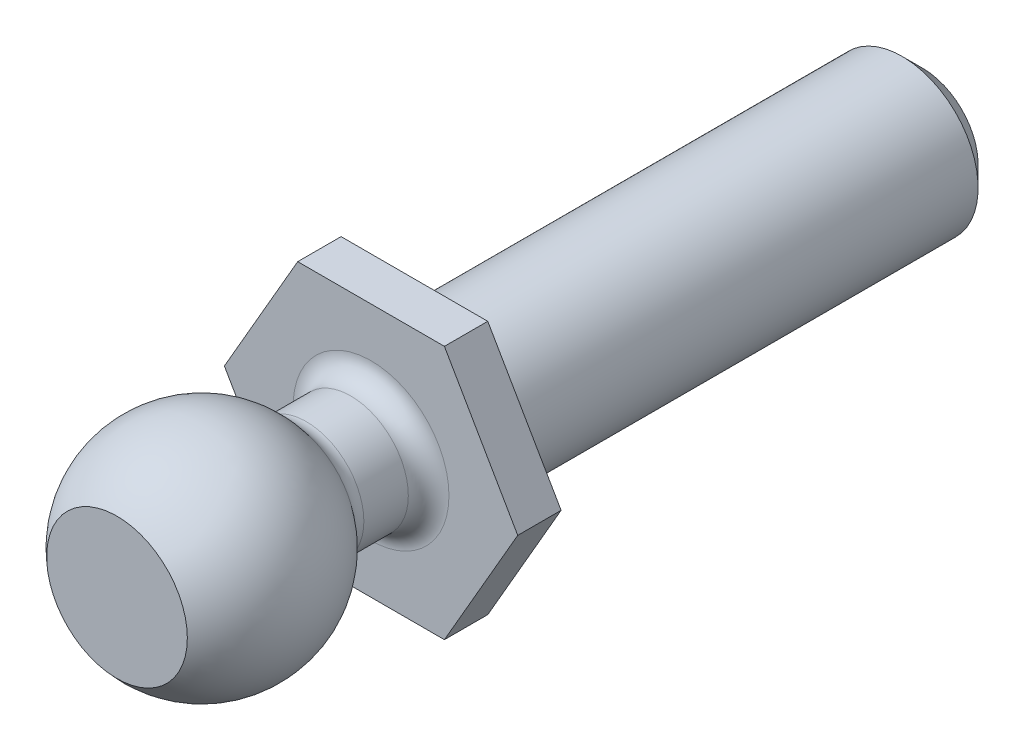
ISO-10303-21;
HEADER;
FILE_DESCRIPTION(('STEP AP214'),'2;1');
FILE_NAME('part.step','',(''),(''),'','','');
FILE_SCHEMA(('AUTOMOTIVE_DESIGN { 1 0 10303 214 1 1 1 1 }'));
ENDSEC;
DATA;
#1=APPLICATION_CONTEXT('core data for automotive mechanical design processes');
#2=APPLICATION_PROTOCOL_DEFINITION('international standard','automotive_design',2000,#1);
#3=PRODUCT_CONTEXT('',#1,'mechanical');
#4=PRODUCT('Part','Part','',(#3));
#5=PRODUCT_RELATED_PRODUCT_CATEGORY('part','',(#4));
#6=PRODUCT_DEFINITION_FORMATION('','',#4);
#7=PRODUCT_DEFINITION_CONTEXT('part definition',#1,'design');
#8=PRODUCT_DEFINITION('design','',#6,#7);
#9=PRODUCT_DEFINITION_SHAPE('','',#8);
#10=(LENGTH_UNIT() NAMED_UNIT(*) SI_UNIT(.MILLI.,.METRE.));
#11=(NAMED_UNIT(*) PLANE_ANGLE_UNIT() SI_UNIT($,.RADIAN.));
#12=(NAMED_UNIT(*) SI_UNIT($,.STERADIAN.) SOLID_ANGLE_UNIT());
#13=UNCERTAINTY_MEASURE_WITH_UNIT(LENGTH_MEASURE(1.E-05),#10,'distance_accuracy_value','');
#14=(GEOMETRIC_REPRESENTATION_CONTEXT(3) GLOBAL_UNCERTAINTY_ASSIGNED_CONTEXT((#13)) GLOBAL_UNIT_ASSIGNED_CONTEXT((#10,
#11,#12)) REPRESENTATION_CONTEXT('',''));
#15=CARTESIAN_POINT('',(0.,0.,0.));
#16=DIRECTION('',(0.,0.,1.));
#17=DIRECTION('',(1.,0.,0.));
#18=AXIS2_PLACEMENT_3D('',#15,#16,#17);
#19=CARTESIAN_POINT('',(0.,0.,5.5753));
#20=DIRECTION('',(0.,0.,1.));
#21=DIRECTION('',(1.,0.,0.));
#22=AXIS2_PLACEMENT_3D('',#19,#20,#21);
#23=PLANE('',#22);
#24=CARTESIAN_POINT('',(0.,0.,5.5753));
#25=DIRECTION('',(0.,0.,1.));
#26=DIRECTION('',(1.,0.,0.));
#27=AXIS2_PLACEMENT_3D('',#24,#25,#26);
#28=CIRCLE('',#27,1.31867653823824);
#29=CARTESIAN_POINT('',(1.31867653823824,0.,5.5753));
#30=VERTEX_POINT('',#29);
#31=EDGE_CURVE('E39',#30,#30,#28,.F.);
#32=ORIENTED_EDGE('',*,*,#31,.F.);
#33=EDGE_LOOP('',(#32));
#34=FACE_BOUND('',#33,.T.);
#35=ADVANCED_FACE('F35',(#34),#23,.T.);
#36=CARTESIAN_POINT('',(0.,0.,-9.525));
#37=DIRECTION('',(0.,0.,-1.));
#38=DIRECTION('',(-1.,0.,0.));
#39=AXIS2_PLACEMENT_3D('',#36,#37,#38);
#40=PLANE('',#39);
#41=CARTESIAN_POINT('',(0.,0.,-9.525));
#42=DIRECTION('',(0.,0.,-1.));
#43=DIRECTION('',(-1.,0.,0.));
#44=AXIS2_PLACEMENT_3D('',#41,#42,#43);
#45=CIRCLE('',#44,1.04140000000001);
#46=CARTESIAN_POINT('',(-1.04140000000001,0.,-9.525));
#47=VERTEX_POINT('',#46);
#48=EDGE_CURVE('E139',#47,#47,#45,.T.);
#49=ORIENTED_EDGE('',*,*,#48,.T.);
#50=EDGE_LOOP('',(#49));
#51=FACE_BOUND('',#50,.T.);
#52=ADVANCED_FACE('F186',(#51),#40,.T.);
#53=CARTESIAN_POINT('',(0.,0.,-9.525));
#54=DIRECTION('',(0.,0.,1.));
#55=DIRECTION('',(1.,0.,0.));
#56=AXIS2_PLACEMENT_3D('',#53,#54,#55);
#57=CONICAL_SURFACE('',#56,1.04140000000001,0.78539816339745);
#58=CARTESIAN_POINT('',(0.,0.,-9.14400000000001));
#59=DIRECTION('',(0.,0.,-1.));
#60=DIRECTION('',(-1.,0.,0.));
#61=AXIS2_PLACEMENT_3D('',#58,#59,#60);
#62=CIRCLE('',#61,1.4224);
#63=CARTESIAN_POINT('',(-1.4224,0.,-9.14400000000001));
#64=VERTEX_POINT('',#63);
#65=EDGE_CURVE('E146',#64,#64,#62,.F.);
#66=ORIENTED_EDGE('',*,*,#65,.F.);
#67=EDGE_LOOP('',(#66));
#68=FACE_BOUND('',#67,.T.);
#69=ORIENTED_EDGE('',*,*,#48,.F.);
#70=EDGE_LOOP('',(#69));
#71=FACE_BOUND('',#70,.T.);
#72=ADVANCED_FACE('F188',(#68,#71),#57,.T.);
#73=CARTESIAN_POINT('',(0.,0.,-9.525));
#74=DIRECTION('',(0.,0.,1.));
#75=DIRECTION('',(1.,0.,0.));
#76=AXIS2_PLACEMENT_3D('',#73,#74,#75);
#77=CYLINDRICAL_SURFACE('',#76,1.4224);
#78=ORIENTED_EDGE('',*,*,#65,.T.);
#79=EDGE_LOOP('',(#78));
#80=FACE_BOUND('',#79,.T.);
#81=CARTESIAN_POINT('',(0.,0.,0.));
#82=DIRECTION('',(0.,0.,-1.));
#83=DIRECTION('',(-1.,0.,0.));
#84=AXIS2_PLACEMENT_3D('',#81,#82,#83);
#85=CIRCLE('',#84,1.4224);
#86=CARTESIAN_POINT('',(-1.4224,0.,0.));
#87=VERTEX_POINT('',#86);
#88=EDGE_CURVE('E136',#87,#87,#85,.T.);
#89=ORIENTED_EDGE('',*,*,#88,.T.);
#90=EDGE_LOOP('',(#89));
#91=FACE_BOUND('',#90,.T.);
#92=ADVANCED_FACE('F194',(#80,#91),#77,.T.);
#93=CARTESIAN_POINT('',(0.,0.,0.));
#94=DIRECTION('',(0.,0.,1.));
#95=DIRECTION('',(1.,0.,0.));
#96=AXIS2_PLACEMENT_3D('',#93,#94,#95);
#97=PLANE('',#96);
#98=ORIENTED_EDGE('',*,*,#88,.F.);
#99=EDGE_LOOP('',(#98));
#100=FACE_BOUND('',#99,.T.);
#101=DIRECTION('',(0.499999999999995,0.866025403784442,0.));
#102=VECTOR('',#101,1.);
#103=CARTESIAN_POINT('',(1.37481532850782,-2.38124999999998,0.));
#104=LINE('',#103,#102);
#105=CARTESIAN_POINT('',(1.37481532850782,-2.38124999999998,0.));
#106=VERTEX_POINT('',#105);
#107=CARTESIAN_POINT('',(2.74963065701558,0.,0.));
#108=VERTEX_POINT('',#107);
#109=EDGE_CURVE('E46',#106,#108,#104,.T.);
#110=ORIENTED_EDGE('',*,*,#109,.F.);
#111=DIRECTION('',(1.,0.,0.));
#112=VECTOR('',#111,1.);
#113=CARTESIAN_POINT('',(-1.37481532850777,-2.38125,0.));
#114=LINE('',#113,#112);
#115=CARTESIAN_POINT('',(-1.37481532850777,-2.38125,0.));
#116=VERTEX_POINT('',#115);
#117=EDGE_CURVE('E88',#116,#106,#114,.T.);
#118=ORIENTED_EDGE('',*,*,#117,.F.);
#119=DIRECTION('',(0.500000000000007,-0.866025403784434,0.));
#120=VECTOR('',#119,1.);
#121=CARTESIAN_POINT('',(-2.74963065701558,0.,0.));
#122=LINE('',#121,#120);
#123=CARTESIAN_POINT('',(-2.74963065701558,0.,0.));
#124=VERTEX_POINT('',#123);
#125=EDGE_CURVE('E118',#124,#116,#122,.T.);
#126=ORIENTED_EDGE('',*,*,#125,.F.);
#127=DIRECTION('',(-0.499999999999995,-0.866025403784441,0.));
#128=VECTOR('',#127,1.);
#129=CARTESIAN_POINT('',(-1.3748153285078,2.38124999999999,0.));
#130=LINE('',#129,#128);
#131=CARTESIAN_POINT('',(-1.3748153285078,2.38124999999999,0.));
#132=VERTEX_POINT('',#131);
#133=EDGE_CURVE('E107',#132,#124,#130,.T.);
#134=ORIENTED_EDGE('',*,*,#133,.F.);
#135=DIRECTION('',(-1.,0.,0.));
#136=VECTOR('',#135,1.);
#137=CARTESIAN_POINT('',(1.37481532850779,2.38124999999999,0.));
#138=LINE('',#137,#136);
#139=CARTESIAN_POINT('',(1.37481532850779,2.38124999999999,0.));
#140=VERTEX_POINT('',#139);
#141=EDGE_CURVE('E99',#140,#132,#138,.T.);
#142=ORIENTED_EDGE('',*,*,#141,.F.);
#143=DIRECTION('',(-0.500000000000001,0.866025403784438,0.));
#144=VECTOR('',#143,1.);
#145=CARTESIAN_POINT('',(2.74963065701558,0.,0.));
#146=LINE('',#145,#144);
#147=EDGE_CURVE('E55',#108,#140,#146,.T.);
#148=ORIENTED_EDGE('',*,*,#147,.F.);
#149=EDGE_LOOP('',(#110,#118,#126,#134,#142,#148));
#150=FACE_BOUND('',#149,.T.);
#151=ADVANCED_FACE('F117',(#100,#150),#97,.F.);
#152=CARTESIAN_POINT('',(-1.37481532850777,-2.38125,0.8128));
#153=DIRECTION('',(0.,1.,0.));
#154=DIRECTION('',(-1.,0.,0.));
#155=AXIS2_PLACEMENT_3D('',#152,#153,#154);
#156=PLANE('',#155);
#157=ORIENTED_EDGE('',*,*,#117,.T.);
#158=DIRECTION('',(0.,0.,-1.));
#159=VECTOR('',#158,1.);
#160=CARTESIAN_POINT('',(1.37481532850782,-2.38124999999998,0.8128));
#161=LINE('',#160,#159);
#162=CARTESIAN_POINT('',(1.37481532850782,-2.38124999999998,0.8128));
#163=VERTEX_POINT('',#162);
#164=EDGE_CURVE('E129',#163,#106,#161,.T.);
#165=ORIENTED_EDGE('',*,*,#164,.F.);
#166=DIRECTION('',(1.,0.,0.));
#167=VECTOR('',#166,1.);
#168=CARTESIAN_POINT('',(-1.37481532850777,-2.38125,0.8128));
#169=LINE('',#168,#167);
#170=CARTESIAN_POINT('',(-1.37481532850777,-2.38125,0.8128));
#171=VERTEX_POINT('',#170);
#172=EDGE_CURVE('E126',#171,#163,#169,.T.);
#173=ORIENTED_EDGE('',*,*,#172,.F.);
#174=DIRECTION('',(0.,0.,-1.));
#175=VECTOR('',#174,1.);
#176=CARTESIAN_POINT('',(-1.37481532850777,-2.38125,0.8128));
#177=LINE('',#176,#175);
#178=EDGE_CURVE('E165',#171,#116,#177,.T.);
#179=ORIENTED_EDGE('',*,*,#178,.T.);
#180=EDGE_LOOP('',(#157,#165,#173,#179));
#181=FACE_BOUND('',#180,.T.);
#182=ADVANCED_FACE('F172',(#181),#156,.F.);
#183=CARTESIAN_POINT('',(-2.74963065701558,0.,0.8128));
#184=DIRECTION('',(0.866025403784435,0.500000000000007,0.));
#185=DIRECTION('',(-0.500000000000007,0.866025403784435,0.));
#186=AXIS2_PLACEMENT_3D('',#183,#184,#185);
#187=PLANE('',#186);
#188=ORIENTED_EDGE('',*,*,#125,.T.);
#189=ORIENTED_EDGE('',*,*,#178,.F.);
#190=DIRECTION('',(0.500000000000007,-0.866025403784434,0.));
#191=VECTOR('',#190,1.);
#192=CARTESIAN_POINT('',(-2.74963065701558,0.,0.8128));
#193=LINE('',#192,#191);
#194=CARTESIAN_POINT('',(-2.74963065701558,0.,0.8128));
#195=VERTEX_POINT('',#194);
#196=EDGE_CURVE('E128',#195,#171,#193,.T.);
#197=ORIENTED_EDGE('',*,*,#196,.F.);
#198=DIRECTION('',(0.,0.,-1.));
#199=VECTOR('',#198,1.);
#200=CARTESIAN_POINT('',(-2.74963065701558,0.,0.8128));
#201=LINE('',#200,#199);
#202=EDGE_CURVE('E114',#195,#124,#201,.T.);
#203=ORIENTED_EDGE('',*,*,#202,.T.);
#204=EDGE_LOOP('',(#188,#189,#197,#203));
#205=FACE_BOUND('',#204,.T.);
#206=ADVANCED_FACE('F177',(#205),#187,.F.);
#207=CARTESIAN_POINT('',(-1.3748153285078,2.38124999999999,0.8128));
#208=DIRECTION('',(0.866025403784441,-0.499999999999995,0.));
#209=DIRECTION('',(0.499999999999995,0.866025403784442,0.));
#210=AXIS2_PLACEMENT_3D('',#207,#208,#209);
#211=PLANE('',#210);
#212=ORIENTED_EDGE('',*,*,#133,.T.);
#213=ORIENTED_EDGE('',*,*,#202,.F.);
#214=DIRECTION('',(-0.499999999999995,-0.866025403784441,0.));
#215=VECTOR('',#214,1.);
#216=CARTESIAN_POINT('',(-1.3748153285078,2.38124999999999,0.8128));
#217=LINE('',#216,#215);
#218=CARTESIAN_POINT('',(-1.3748153285078,2.38124999999999,0.8128));
#219=VERTEX_POINT('',#218);
#220=EDGE_CURVE('E113',#219,#195,#217,.T.);
#221=ORIENTED_EDGE('',*,*,#220,.F.);
#222=DIRECTION('',(0.,0.,-1.));
#223=VECTOR('',#222,1.);
#224=CARTESIAN_POINT('',(-1.3748153285078,2.38124999999999,0.8128));
#225=LINE('',#224,#223);
#226=EDGE_CURVE('E103',#219,#132,#225,.T.);
#227=ORIENTED_EDGE('',*,*,#226,.T.);
#228=EDGE_LOOP('',(#212,#213,#221,#227));
#229=FACE_BOUND('',#228,.T.);
#230=ADVANCED_FACE('F110',(#229),#211,.F.);
#231=CARTESIAN_POINT('',(1.37481532850779,2.38124999999999,0.8128));
#232=DIRECTION('',(0.,-1.,0.));
#233=DIRECTION('',(1.,0.,0.));
#234=AXIS2_PLACEMENT_3D('',#231,#232,#233);
#235=PLANE('',#234);
#236=ORIENTED_EDGE('',*,*,#141,.T.);
#237=ORIENTED_EDGE('',*,*,#226,.F.);
#238=DIRECTION('',(-1.,0.,0.));
#239=VECTOR('',#238,1.);
#240=CARTESIAN_POINT('',(1.37481532850779,2.38124999999999,0.8128));
#241=LINE('',#240,#239);
#242=CARTESIAN_POINT('',(1.37481532850779,2.38124999999999,0.8128));
#243=VERTEX_POINT('',#242);
#244=EDGE_CURVE('E132',#243,#219,#241,.T.);
#245=ORIENTED_EDGE('',*,*,#244,.F.);
#246=DIRECTION('',(0.,0.,-1.));
#247=VECTOR('',#246,1.);
#248=CARTESIAN_POINT('',(1.37481532850779,2.38124999999999,0.8128));
#249=LINE('',#248,#247);
#250=EDGE_CURVE('E105',#243,#140,#249,.T.);
#251=ORIENTED_EDGE('',*,*,#250,.T.);
#252=EDGE_LOOP('',(#236,#237,#245,#251));
#253=FACE_BOUND('',#252,.T.);
#254=ADVANCED_FACE('F101',(#253),#235,.F.);
#255=CARTESIAN_POINT('',(2.74963065701558,0.,0.8128));
#256=DIRECTION('',(-0.866025403784438,-0.500000000000001,0.));
#257=DIRECTION('',(0.500000000000001,-0.866025403784438,0.));
#258=AXIS2_PLACEMENT_3D('',#255,#256,#257);
#259=PLANE('',#258);
#260=ORIENTED_EDGE('',*,*,#147,.T.);
#261=ORIENTED_EDGE('',*,*,#250,.F.);
#262=DIRECTION('',(-0.500000000000001,0.866025403784438,0.));
#263=VECTOR('',#262,1.);
#264=CARTESIAN_POINT('',(2.74963065701558,0.,0.8128));
#265=LINE('',#264,#263);
#266=CARTESIAN_POINT('',(2.74963065701558,0.,0.8128));
#267=VERTEX_POINT('',#266);
#268=EDGE_CURVE('E77',#267,#243,#265,.T.);
#269=ORIENTED_EDGE('',*,*,#268,.F.);
#270=DIRECTION('',(0.,0.,-1.));
#271=VECTOR('',#270,1.);
#272=CARTESIAN_POINT('',(2.74963065701558,0.,0.8128));
#273=LINE('',#272,#271);
#274=EDGE_CURVE('E161',#267,#108,#273,.T.);
#275=ORIENTED_EDGE('',*,*,#274,.T.);
#276=EDGE_LOOP('',(#260,#261,#269,#275));
#277=FACE_BOUND('',#276,.T.);
#278=ADVANCED_FACE('F250',(#277),#259,.F.);
#279=CARTESIAN_POINT('',(1.37481532850782,-2.38124999999998,0.8128));
#280=DIRECTION('',(-0.866025403784442,0.499999999999995,0.));
#281=DIRECTION('',(-0.499999999999995,-0.866025403784442,0.));
#282=AXIS2_PLACEMENT_3D('',#279,#280,#281);
#283=PLANE('',#282);
#284=ORIENTED_EDGE('',*,*,#109,.T.);
#285=ORIENTED_EDGE('',*,*,#274,.F.);
#286=DIRECTION('',(0.499999999999995,0.866025403784442,0.));
#287=VECTOR('',#286,1.);
#288=CARTESIAN_POINT('',(1.37481532850782,-2.38124999999998,0.8128));
#289=LINE('',#288,#287);
#290=EDGE_CURVE('E135',#163,#267,#289,.T.);
#291=ORIENTED_EDGE('',*,*,#290,.F.);
#292=ORIENTED_EDGE('',*,*,#164,.T.);
#293=EDGE_LOOP('',(#284,#285,#291,#292));
#294=FACE_BOUND('',#293,.T.);
#295=ADVANCED_FACE('F169',(#294),#283,.F.);
#296=CARTESIAN_POINT('',(0.,0.,0.8128));
#297=DIRECTION('',(0.,0.,1.));
#298=DIRECTION('',(1.,0.,0.));
#299=AXIS2_PLACEMENT_3D('',#296,#297,#298);
#300=PLANE('',#299);
#301=CARTESIAN_POINT('',(0.,0.,0.8128));
#302=DIRECTION('',(0.,0.,1.));
#303=DIRECTION('',(1.,0.,0.));
#304=AXIS2_PLACEMENT_3D('',#301,#302,#303);
#305=CIRCLE('',#304,1.4605);
#306=CARTESIAN_POINT('',(1.4605,0.,0.8128));
#307=VERTEX_POINT('',#306);
#308=EDGE_CURVE('E138',#307,#307,#305,.F.);
#309=ORIENTED_EDGE('',*,*,#308,.T.);
#310=EDGE_LOOP('',(#309));
#311=FACE_BOUND('',#310,.T.);
#312=ORIENTED_EDGE('',*,*,#290,.T.);
#313=ORIENTED_EDGE('',*,*,#268,.T.);
#314=ORIENTED_EDGE('',*,*,#244,.T.);
#315=ORIENTED_EDGE('',*,*,#220,.T.);
#316=ORIENTED_EDGE('',*,*,#196,.T.);
#317=ORIENTED_EDGE('',*,*,#172,.T.);
#318=EDGE_LOOP('',(#312,#313,#314,#315,#316,#317));
#319=FACE_BOUND('',#318,.T.);
#320=ADVANCED_FACE('F174',(#311,#319),#300,.T.);
#321=CARTESIAN_POINT('',(0.,0.,1.1938));
#322=DIRECTION('',(0.,0.,1.));
#323=DIRECTION('',(1.,0.,0.));
#324=AXIS2_PLACEMENT_3D('',#321,#322,#323);
#325=TOROIDAL_SURFACE('',#324,1.4605,0.381);
#326=ORIENTED_EDGE('',*,*,#308,.F.);
#327=EDGE_LOOP('',(#326));
#328=FACE_BOUND('',#327,.T.);
#329=CARTESIAN_POINT('',(0.,0.,1.1938));
#330=DIRECTION('',(0.,0.,1.));
#331=DIRECTION('',(1.,0.,0.));
#332=AXIS2_PLACEMENT_3D('',#329,#330,#331);
#333=CIRCLE('',#332,1.0795);
#334=CARTESIAN_POINT('',(1.0795,0.,1.1938));
#335=VERTEX_POINT('',#334);
#336=EDGE_CURVE('E158',#335,#335,#333,.T.);
#337=ORIENTED_EDGE('',*,*,#336,.F.);
#338=EDGE_LOOP('',(#337));
#339=FACE_BOUND('',#338,.T.);
#340=ADVANCED_FACE('F215',(#328,#339),#325,.F.);
#341=CARTESIAN_POINT('',(0.,0.,3.9878));
#342=DIRECTION('',(0.,0.,-1.));
#343=DIRECTION('',(-1.,0.,0.));
#344=AXIS2_PLACEMENT_3D('',#341,#342,#343);
#345=CYLINDRICAL_SURFACE('',#344,1.0795);
#346=CARTESIAN_POINT('',(0.,0.,2.02725356787961));
#347=DIRECTION('',(0.,0.,1.));
#348=DIRECTION('',(1.,0.,0.));
#349=AXIS2_PLACEMENT_3D('',#346,#347,#348);
#350=CIRCLE('',#349,1.0795);
#351=CARTESIAN_POINT('',(1.0795,0.,2.02725356787961));
#352=VERTEX_POINT('',#351);
#353=EDGE_CURVE('E155',#352,#352,#350,.F.);
#354=ORIENTED_EDGE('',*,*,#353,.T.);
#355=EDGE_LOOP('',(#354));
#356=FACE_BOUND('',#355,.T.);
#357=ORIENTED_EDGE('',*,*,#336,.T.);
#358=EDGE_LOOP('',(#357));
#359=FACE_BOUND('',#358,.T.);
#360=ADVANCED_FACE('F211',(#356,#359),#345,.T.);
#361=CARTESIAN_POINT('',(0.,0.,2.02725356787961));
#362=DIRECTION('',(0.,0.,1.));
#363=DIRECTION('',(1.,0.,0.));
#364=AXIS2_PLACEMENT_3D('',#361,#362,#363);
#365=TOROIDAL_SURFACE('',#364,1.4605,0.381);
#366=CARTESIAN_POINT('',(0.,0.,2.33279327158668));
#367=DIRECTION('',(0.,0.,1.));
#368=DIRECTION('',(1.,0.,0.));
#369=AXIS2_PLACEMENT_3D('',#366,#367,#368);
#370=CIRCLE('',#369,1.23288961038961);
#371=CARTESIAN_POINT('',(1.23288961038961,0.,2.33279327158668));
#372=VERTEX_POINT('',#371);
#373=EDGE_CURVE('E143',#372,#372,#370,.T.);
#374=ORIENTED_EDGE('',*,*,#373,.F.);
#375=EDGE_LOOP('',(#374));
#376=FACE_BOUND('',#375,.T.);
#377=ORIENTED_EDGE('',*,*,#353,.F.);
#378=EDGE_LOOP('',(#377));
#379=FACE_BOUND('',#378,.T.);
#380=ADVANCED_FACE('F214',(#376,#379),#365,.F.);
#381=CARTESIAN_POINT('',(0.,0.,3.9878));
#382=DIRECTION('',(0.,1.,0.));
#383=DIRECTION('',(1.,0.,0.));
#384=AXIS2_PLACEMENT_3D('',#381,#382,#383);
#385=SPHERICAL_SURFACE('',#384,2.06375);
#386=CARTESIAN_POINT('',(0.,0.,3.9878));
#387=DIRECTION('',(0.,0.,1.));
#388=DIRECTION('',(1.,0.,0.));
#389=AXIS2_PLACEMENT_3D('',#386,#387,#388);
#390=SPHERICAL_SURFACE('',#389,2.06375);
#391=ORIENTED_EDGE('',*,*,#373,.T.);
#392=EDGE_LOOP('',(#391));
#393=FACE_BOUND('',#392,.T.);
#394=ORIENTED_EDGE('',*,*,#31,.T.);
#395=EDGE_LOOP('',(#394));
#396=FACE_BOUND('',#395,.T.);
#397=ADVANCED_FACE('F37',(#393,#396),#390,.T.);
#398=CLOSED_SHELL('',(#35,#52,#72,#92,#151,#182,#206,#230,#254,#278,#295,#320,#340,#360,#380,#397));
#399=CARTESIAN_POINT('',(0.,0.,3.9878));
#400=DIRECTION('',(0.,1.,0.));
#401=DIRECTION('',(1.,0.,0.));
#402=AXIS2_PLACEMENT_3D('',#399,#400,#401);
#403=SPHERICAL_SURFACE('',#402,1.0795);
#404=CARTESIAN_POINT('',(0.,0.,3.9878));
#405=DIRECTION('',(0.,0.,1.));
#406=DIRECTION('',(1.,0.,0.));
#407=AXIS2_PLACEMENT_3D('',#404,#405,#406);
#408=SPHERICAL_SURFACE('',#407,1.0795);
#409=CARTESIAN_POINT('',(0.,0.,3.9878));
#410=DIRECTION('',(0.,0.,1.));
#411=DIRECTION('',(1.,0.,0.));
#412=AXIS2_PLACEMENT_3D('',#409,#410,#411);
#413=CIRCLE('',#412,1.0795);
#414=CARTESIAN_POINT('',(1.0795,0.,3.9878));
#415=VERTEX_POINT('',#414);
#416=EDGE_CURVE('E11',#415,#415,#413,.T.);
#417=ORIENTED_EDGE('',*,*,#416,.F.);
#418=EDGE_LOOP('',(#417));
#419=FACE_BOUND('',#418,.T.);
#420=ADVANCED_FACE('F202',(#419),#408,.F.);
#421=CARTESIAN_POINT('',(0.,0.,3.9878));
#422=DIRECTION('',(0.,0.,1.));
#423=DIRECTION('',(1.,0.,0.));
#424=AXIS2_PLACEMENT_3D('',#421,#422,#423);
#425=PLANE('',#424);
#426=ORIENTED_EDGE('',*,*,#416,.T.);
#427=EDGE_LOOP('',(#426));
#428=FACE_BOUND('',#427,.T.);
#429=ADVANCED_FACE('F205',(#428),#425,.T.);
#430=CLOSED_SHELL('',(#420,#429));
#431=ORIENTED_CLOSED_SHELL('',*,#430,.T.);
#432=BREP_WITH_VOIDS('B2',#398,(#431));
#433=ADVANCED_BREP_SHAPE_REPRESENTATION('',(#18,#432),#14);
#434=SHAPE_DEFINITION_REPRESENTATION(#9,#433);
ENDSEC;
END-ISO-10303-21;
